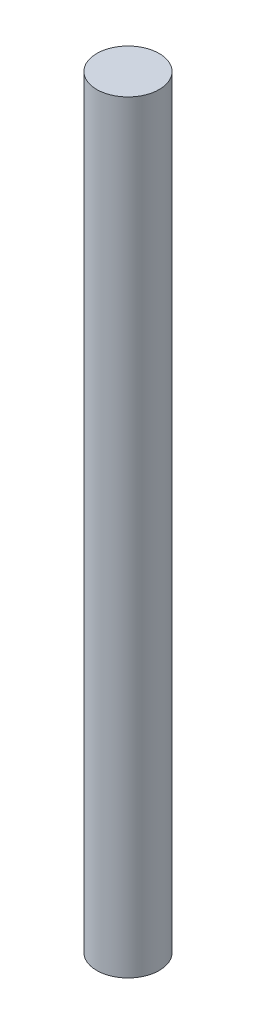
ISO-10303-21;
HEADER;
FILE_DESCRIPTION(('STEP AP214'),'2;1');
FILE_NAME('part.step','',(''),(''),'','','');
FILE_SCHEMA(('AUTOMOTIVE_DESIGN { 1 0 10303 214 1 1 1 1 }'));
ENDSEC;
DATA;
#1=APPLICATION_CONTEXT('core data for automotive mechanical design processes');
#2=APPLICATION_PROTOCOL_DEFINITION('international standard','automotive_design',2000,#1);
#3=PRODUCT_CONTEXT('',#1,'mechanical');
#4=PRODUCT('Part','Part','',(#3));
#5=PRODUCT_RELATED_PRODUCT_CATEGORY('part','',(#4));
#6=PRODUCT_DEFINITION_FORMATION('','',#4);
#7=PRODUCT_DEFINITION_CONTEXT('part definition',#1,'design');
#8=PRODUCT_DEFINITION('design','',#6,#7);
#9=PRODUCT_DEFINITION_SHAPE('','',#8);
#10=(LENGTH_UNIT() NAMED_UNIT(*) SI_UNIT(.MILLI.,.METRE.));
#11=(NAMED_UNIT(*) PLANE_ANGLE_UNIT() SI_UNIT($,.RADIAN.));
#12=(NAMED_UNIT(*) SI_UNIT($,.STERADIAN.) SOLID_ANGLE_UNIT());
#13=UNCERTAINTY_MEASURE_WITH_UNIT(LENGTH_MEASURE(1.E-05),#10,'distance_accuracy_value','');
#14=(GEOMETRIC_REPRESENTATION_CONTEXT(3) GLOBAL_UNCERTAINTY_ASSIGNED_CONTEXT((#13)) GLOBAL_UNIT_ASSIGNED_CONTEXT((#10,
#11,#12)) REPRESENTATION_CONTEXT('',''));
#15=CARTESIAN_POINT('',(0.,0.,0.));
#16=DIRECTION('',(0.,0.,1.));
#17=DIRECTION('',(1.,0.,0.));
#18=AXIS2_PLACEMENT_3D('',#15,#16,#17);
#19=CARTESIAN_POINT('',(0.,55.,0.));
#20=DIRECTION('',(0.,-1.,0.));
#21=DIRECTION('',(0.,0.,-1.));
#22=AXIS2_PLACEMENT_3D('',#19,#20,#21);
#23=CYLINDRICAL_SURFACE('',#22,2.25);
#24=CARTESIAN_POINT('',(0.,55.,0.));
#25=DIRECTION('',(0.,1.,0.));
#26=DIRECTION('',(0.,0.,1.));
#27=AXIS2_PLACEMENT_3D('',#24,#25,#26);
#28=CIRCLE('',#27,2.25);
#29=CARTESIAN_POINT('',(0.,55.,2.25));
#30=VERTEX_POINT('',#29);
#31=EDGE_CURVE('E10',#30,#30,#28,.T.);
#32=ORIENTED_EDGE('',*,*,#31,.F.);
#33=EDGE_LOOP('',(#32));
#34=FACE_BOUND('',#33,.T.);
#35=CARTESIAN_POINT('',(0.,0.,0.));
#36=DIRECTION('',(0.,1.,0.));
#37=DIRECTION('',(0.,0.,1.));
#38=AXIS2_PLACEMENT_3D('',#35,#36,#37);
#39=CIRCLE('',#38,2.25);
#40=CARTESIAN_POINT('',(0.,0.,2.25));
#41=VERTEX_POINT('',#40);
#42=EDGE_CURVE('E34',#41,#41,#39,.T.);
#43=ORIENTED_EDGE('',*,*,#42,.T.);
#44=EDGE_LOOP('',(#43));
#45=FACE_BOUND('',#44,.T.);
#46=ADVANCED_FACE('F31',(#34,#45),#23,.T.);
#47=CARTESIAN_POINT('',(0.,55.,0.));
#48=DIRECTION('',(0.,1.,0.));
#49=DIRECTION('',(0.,0.,1.));
#50=AXIS2_PLACEMENT_3D('',#47,#48,#49);
#51=PLANE('',#50);
#52=ORIENTED_EDGE('',*,*,#31,.T.);
#53=EDGE_LOOP('',(#52));
#54=FACE_BOUND('',#53,.T.);
#55=ADVANCED_FACE('F46',(#54),#51,.T.);
#56=CARTESIAN_POINT('',(0.,0.,0.));
#57=DIRECTION('',(0.,1.,0.));
#58=DIRECTION('',(0.,0.,1.));
#59=AXIS2_PLACEMENT_3D('',#56,#57,#58);
#60=PLANE('',#59);
#61=ORIENTED_EDGE('',*,*,#42,.F.);
#62=EDGE_LOOP('',(#61));
#63=FACE_BOUND('',#62,.T.);
#64=ADVANCED_FACE('F44',(#63),#60,.F.);
#65=CLOSED_SHELL('',(#46,#55,#64));
#66=MANIFOLD_SOLID_BREP('B2',#65);
#67=ADVANCED_BREP_SHAPE_REPRESENTATION('',(#18,#66),#14);
#68=SHAPE_DEFINITION_REPRESENTATION(#9,#67);
ENDSEC;
END-ISO-10303-21;
